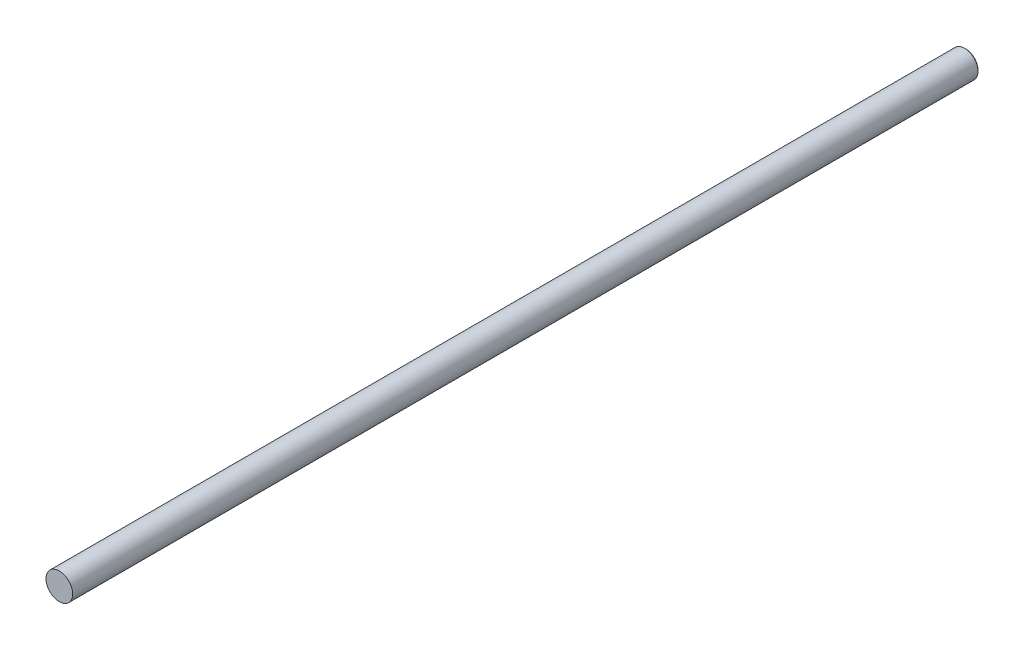
ISO-10303-21;
HEADER;
FILE_DESCRIPTION(('STEP AP214'),'2;1');
FILE_NAME('part.step','',(''),(''),'','','');
FILE_SCHEMA(('AUTOMOTIVE_DESIGN { 1 0 10303 214 1 1 1 1 }'));
ENDSEC;
DATA;
#1=APPLICATION_CONTEXT('core data for automotive mechanical design processes');
#2=APPLICATION_PROTOCOL_DEFINITION('international standard','automotive_design',2000,#1);
#3=PRODUCT_CONTEXT('',#1,'mechanical');
#4=PRODUCT('Part','Part','',(#3));
#5=PRODUCT_RELATED_PRODUCT_CATEGORY('part','',(#4));
#6=PRODUCT_DEFINITION_FORMATION('','',#4);
#7=PRODUCT_DEFINITION_CONTEXT('part definition',#1,'design');
#8=PRODUCT_DEFINITION('design','',#6,#7);
#9=PRODUCT_DEFINITION_SHAPE('','',#8);
#10=(LENGTH_UNIT() NAMED_UNIT(*) SI_UNIT(.MILLI.,.METRE.));
#11=(NAMED_UNIT(*) PLANE_ANGLE_UNIT() SI_UNIT($,.RADIAN.));
#12=(NAMED_UNIT(*) SI_UNIT($,.STERADIAN.) SOLID_ANGLE_UNIT());
#13=UNCERTAINTY_MEASURE_WITH_UNIT(LENGTH_MEASURE(1.E-05),#10,'distance_accuracy_value','');
#14=(GEOMETRIC_REPRESENTATION_CONTEXT(3) GLOBAL_UNCERTAINTY_ASSIGNED_CONTEXT((#13)) GLOBAL_UNIT_ASSIGNED_CONTEXT((#10,
#11,#12)) REPRESENTATION_CONTEXT('',''));
#15=CARTESIAN_POINT('',(0.,0.,0.));
#16=DIRECTION('',(0.,0.,1.));
#17=DIRECTION('',(1.,0.,0.));
#18=AXIS2_PLACEMENT_3D('',#15,#16,#17);
#19=CARTESIAN_POINT('',(0.,0.,-215.9));
#20=DIRECTION('',(0.,0.,1.));
#21=DIRECTION('',(1.,0.,0.));
#22=AXIS2_PLACEMENT_3D('',#19,#20,#21);
#23=CYLINDRICAL_SURFACE('',#22,3.175);
#24=CARTESIAN_POINT('',(0.,0.,-215.646));
#25=DIRECTION('',(0.,0.,1.));
#26=DIRECTION('',(1.,0.,0.));
#27=AXIS2_PLACEMENT_3D('',#24,#25,#26);
#28=CIRCLE('',#27,3.175);
#29=CARTESIAN_POINT('',(3.175,0.,-215.646));
#30=VERTEX_POINT('',#29);
#31=EDGE_CURVE('E36',#30,#30,#28,.T.);
#32=ORIENTED_EDGE('',*,*,#31,.T.);
#33=EDGE_LOOP('',(#32));
#34=FACE_BOUND('',#33,.T.);
#35=CARTESIAN_POINT('',(0.,0.,0.));
#36=DIRECTION('',(0.,0.,1.));
#37=DIRECTION('',(1.,0.,0.));
#38=AXIS2_PLACEMENT_3D('',#35,#36,#37);
#39=CIRCLE('',#38,3.175);
#40=CARTESIAN_POINT('',(3.175,0.,0.));
#41=VERTEX_POINT('',#40);
#42=EDGE_CURVE('E40',#41,#41,#39,.T.);
#43=ORIENTED_EDGE('',*,*,#42,.F.);
#44=EDGE_LOOP('',(#43));
#45=FACE_BOUND('',#44,.T.);
#46=ADVANCED_FACE('F30',(#34,#45),#23,.T.);
#47=CARTESIAN_POINT('',(0.,0.,-215.9));
#48=DIRECTION('',(0.,0.,1.));
#49=DIRECTION('',(1.,0.,0.));
#50=AXIS2_PLACEMENT_3D('',#47,#48,#49);
#51=PLANE('',#50);
#52=CARTESIAN_POINT('',(0.,0.,-215.9));
#53=DIRECTION('',(0.,0.,1.));
#54=DIRECTION('',(1.,0.,0.));
#55=AXIS2_PLACEMENT_3D('',#52,#53,#54);
#56=CIRCLE('',#55,2.921);
#57=CARTESIAN_POINT('',(2.921,0.,-215.9));
#58=VERTEX_POINT('',#57);
#59=EDGE_CURVE('E10',#58,#58,#56,.F.);
#60=ORIENTED_EDGE('',*,*,#59,.T.);
#61=EDGE_LOOP('',(#60));
#62=FACE_BOUND('',#61,.T.);
#63=ADVANCED_FACE('F50',(#62),#51,.F.);
#64=CARTESIAN_POINT('',(0.,0.,0.));
#65=DIRECTION('',(0.,0.,1.));
#66=DIRECTION('',(1.,0.,0.));
#67=AXIS2_PLACEMENT_3D('',#64,#65,#66);
#68=PLANE('',#67);
#69=ORIENTED_EDGE('',*,*,#42,.T.);
#70=EDGE_LOOP('',(#69));
#71=FACE_BOUND('',#70,.T.);
#72=ADVANCED_FACE('F47',(#71),#68,.T.);
#73=CARTESIAN_POINT('',(0.,0.,-215.646));
#74=DIRECTION('',(0.,0.,1.));
#75=DIRECTION('',(1.,0.,0.));
#76=AXIS2_PLACEMENT_3D('',#73,#74,#75);
#77=CONICAL_SURFACE('',#76,3.175,0.785398163397441);
#78=ORIENTED_EDGE('',*,*,#59,.F.);
#79=EDGE_LOOP('',(#78));
#80=FACE_BOUND('',#79,.T.);
#81=ORIENTED_EDGE('',*,*,#31,.F.);
#82=EDGE_LOOP('',(#81));
#83=FACE_BOUND('',#82,.T.);
#84=ADVANCED_FACE('F57',(#80,#83),#77,.T.);
#85=CLOSED_SHELL('',(#46,#63,#72,#84));
#86=MANIFOLD_SOLID_BREP('B2',#85);
#87=ADVANCED_BREP_SHAPE_REPRESENTATION('',(#18,#86),#14);
#88=SHAPE_DEFINITION_REPRESENTATION(#9,#87);
ENDSEC;
END-ISO-10303-21;
